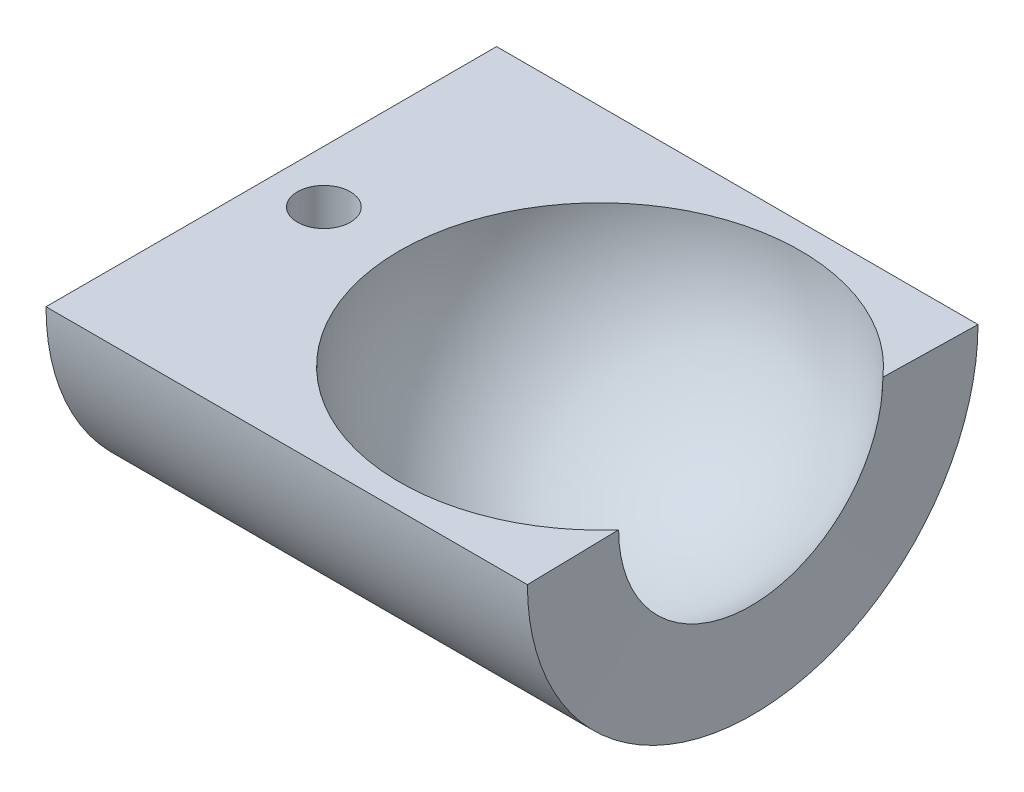
ISO-10303-21;
HEADER;
FILE_DESCRIPTION(('STEP AP214'),'2;1');
FILE_NAME('part.step','',(''),(''),'','','');
FILE_SCHEMA(('AUTOMOTIVE_DESIGN { 1 0 10303 214 1 1 1 1 }'));
ENDSEC;
DATA;
#1=APPLICATION_CONTEXT('core data for automotive mechanical design processes');
#2=APPLICATION_PROTOCOL_DEFINITION('international standard','automotive_design',2000,#1);
#3=PRODUCT_CONTEXT('',#1,'mechanical');
#4=PRODUCT('Part','Part','',(#3));
#5=PRODUCT_RELATED_PRODUCT_CATEGORY('part','',(#4));
#6=PRODUCT_DEFINITION_FORMATION('','',#4);
#7=PRODUCT_DEFINITION_CONTEXT('part definition',#1,'design');
#8=PRODUCT_DEFINITION('design','',#6,#7);
#9=PRODUCT_DEFINITION_SHAPE('','',#8);
#10=(LENGTH_UNIT() NAMED_UNIT(*) SI_UNIT(.MILLI.,.METRE.));
#11=(NAMED_UNIT(*) PLANE_ANGLE_UNIT() SI_UNIT($,.RADIAN.));
#12=(NAMED_UNIT(*) SI_UNIT($,.STERADIAN.) SOLID_ANGLE_UNIT());
#13=UNCERTAINTY_MEASURE_WITH_UNIT(LENGTH_MEASURE(1.E-05),#10,'distance_accuracy_value','');
#14=(GEOMETRIC_REPRESENTATION_CONTEXT(3) GLOBAL_UNCERTAINTY_ASSIGNED_CONTEXT((#13)) GLOBAL_UNIT_ASSIGNED_CONTEXT((#10,
#11,#12)) REPRESENTATION_CONTEXT('',''));
#15=CARTESIAN_POINT('',(0.,0.,0.));
#16=DIRECTION('',(0.,0.,1.));
#17=DIRECTION('',(1.,0.,0.));
#18=AXIS2_PLACEMENT_3D('',#15,#16,#17);
#19=CARTESIAN_POINT('',(0.,0.,0.));
#20=DIRECTION('',(1.,0.,0.));
#21=DIRECTION('',(0.,0.,1.));
#22=AXIS2_PLACEMENT_3D('',#19,#20,#21);
#23=SPHERICAL_SURFACE('',#22,12.5);
#24=CARTESIAN_POINT('',(0.,0.,0.));
#25=DIRECTION('',(0.,-1.,0.));
#26=DIRECTION('',(0.,0.,-1.));
#27=AXIS2_PLACEMENT_3D('',#24,#25,#26);
#28=CIRCLE('',#27,12.5);
#29=CARTESIAN_POINT('',(9.39995104684858,0.,8.23959466945135));
#30=VERTEX_POINT('',#29);
#31=CARTESIAN_POINT('',(9.39995104684858,0.,-8.2395946694513));
#32=VERTEX_POINT('',#31);
#33=EDGE_CURVE('E86',#30,#32,#28,.T.);
#34=ORIENTED_EDGE('',*,*,#33,.F.);
#35=CARTESIAN_POINT('',(9.39995104684858,0.,0.));
#36=DIRECTION('',(1.,0.,0.));
#37=DIRECTION('',(0.,0.,-1.));
#38=AXIS2_PLACEMENT_3D('',#35,#36,#37);
#39=CIRCLE('',#38,8.2395946694513);
#40=EDGE_CURVE('E40',#30,#32,#39,.T.);
#41=ORIENTED_EDGE('',*,*,#40,.T.);
#42=EDGE_LOOP('',(#34,#41));
#43=FACE_BOUND('',#42,.T.);
#44=ADVANCED_FACE('F33',(#43),#23,.F.);
#45=CARTESIAN_POINT('',(9.39995104684858,0.,0.));
#46=DIRECTION('',(1.,0.,0.));
#47=DIRECTION('',(0.,0.,-1.));
#48=AXIS2_PLACEMENT_3D('',#45,#46,#47);
#49=CONICAL_SURFACE('',#48,8.2395946694513,1.54995330868802);
#50=DIRECTION('',(0.0208415089960498,0.,-0.999782792161761));
#51=VECTOR('',#50,1.);
#52=CARTESIAN_POINT('',(9.22818815217436,0.,0.));
#53=LINE('',#52,#51);
#54=CARTESIAN_POINT('',(9.52106407032024,0.,-14.0494770919092));
#55=VERTEX_POINT('',#54);
#56=EDGE_CURVE('E51',#32,#55,#53,.T.);
#57=ORIENTED_EDGE('',*,*,#56,.F.);
#58=ORIENTED_EDGE('',*,*,#40,.F.);
#59=DIRECTION('',(-0.0208415089960498,0.,-0.999782792161761));
#60=VECTOR('',#59,1.);
#61=CARTESIAN_POINT('',(9.22818815217436,0.,0.));
#62=LINE('',#61,#60);
#63=CARTESIAN_POINT('',(9.52106407032024,0.,14.0494770919092));
#64=VERTEX_POINT('',#63);
#65=EDGE_CURVE('E74',#64,#30,#62,.T.);
#66=ORIENTED_EDGE('',*,*,#65,.F.);
#67=CARTESIAN_POINT('',(9.52106407032024,0.,0.));
#68=DIRECTION('',(1.,0.,0.));
#69=DIRECTION('',(0.,0.,-1.));
#70=AXIS2_PLACEMENT_3D('',#67,#68,#69);
#71=CIRCLE('',#70,14.0494770919092);
#72=EDGE_CURVE('E73',#64,#55,#71,.T.);
#73=ORIENTED_EDGE('',*,*,#72,.T.);
#74=EDGE_LOOP('',(#57,#58,#66,#73));
#75=FACE_BOUND('',#74,.T.);
#76=ADVANCED_FACE('F88',(#75),#49,.F.);
#77=CARTESIAN_POINT('',(-12.5,0.,0.));
#78=DIRECTION('',(1.,0.,0.));
#79=DIRECTION('',(0.,0.,-1.));
#80=AXIS2_PLACEMENT_3D('',#77,#78,#79);
#81=CYLINDRICAL_SURFACE('',#80,14.0494770919092);
#82=CARTESIAN_POINT('',(-17.2217247394002,-13.9522509494375,1.65));
#83=CARTESIAN_POINT('',(-17.3140624248878,-13.9522522044542,1.64999604842933));
#84=CARTESIAN_POINT('',(-17.4064589121021,-13.9531774941187,1.64222272634515));
#85=CARTESIAN_POINT('',(-17.5886836352696,-13.9567775667967,1.61133452476932));
#86=CARTESIAN_POINT('',(-17.6785090336758,-13.9594542104296,1.58820332885361));
#87=CARTESIAN_POINT('',(-17.852926694007,-13.966249725223,1.52728795341867));
#88=CARTESIAN_POINT('',(-17.9375223421071,-13.9703676514218,1.48951337293967));
#89=CARTESIAN_POINT('',(-18.0991568720913,-13.9795805993173,1.4004034095764));
#90=CARTESIAN_POINT('',(-18.1761971101884,-13.9846754451677,1.3490704665807));
#91=CARTESIAN_POINT('',(-18.3209324453093,-13.9952964615243,1.2340281192762));
#92=CARTESIAN_POINT('',(-18.3885847019256,-14.0008244400982,1.17026497843969));
#93=CARTESIAN_POINT('',(-18.5122539718135,-14.0116725547336,1.03228770983866));
#94=CARTESIAN_POINT('',(-18.5682704216953,-14.016992680721,0.958073076319042));
#95=CARTESIAN_POINT('',(-18.6672300917753,-14.0268439885374,0.801032119260877));
#96=CARTESIAN_POINT('',(-18.7101347787808,-14.0313728285242,0.71818135455179));
#97=CARTESIAN_POINT('',(-18.7814063138586,-14.0391114692741,0.546388735910669));
#98=CARTESIAN_POINT('',(-18.8097736409872,-14.0423213135018,0.457447082803947));
#99=CARTESIAN_POINT('',(-18.851037868176,-14.0470475773654,0.276434209554184));
#100=CARTESIAN_POINT('',(-18.8640057727092,-14.0485717670527,0.184379381911657));
#101=CARTESIAN_POINT('',(-18.8743229827714,-14.049781488474,-0.000611723869010534));
#102=CARTESIAN_POINT('',(-18.8716728346763,-14.0494670845288,-0.0935479710583573));
#103=CARTESIAN_POINT('',(-18.8508863082696,-14.0470413530556,-0.277181058113593));
#104=CARTESIAN_POINT('',(-18.8328262886412,-14.0449388858708,-0.367886674943284));
#105=CARTESIAN_POINT('',(-18.7818519088057,-14.0391832797136,-0.544970605274975));
#106=CARTESIAN_POINT('',(-18.7489372945614,-14.035530114222,-0.631348844743921));
#107=CARTESIAN_POINT('',(-18.6691060306813,-14.0270683898862,-0.797563853254607));
#108=CARTESIAN_POINT('',(-18.622156094399,-14.0222570897141,-0.877384489861531));
#109=CARTESIAN_POINT('',(-18.5156111204684,-14.0120179016479,-1.02804247992091));
#110=CARTESIAN_POINT('',(-18.4560155707628,-14.0065899887894,-1.09887946941392));
#111=CARTESIAN_POINT('',(-18.3254428129604,-13.99568691565,-1.23000753199177));
#112=CARTESIAN_POINT('',(-18.2543990959494,-13.9902116679069,-1.29023238996543));
#113=CARTESIAN_POINT('',(-18.1031758320774,-13.9798634565398,-1.39791265162449));
#114=CARTESIAN_POINT('',(-18.0229962622927,-13.974990494427,-1.44536802326769));
#115=CARTESIAN_POINT('',(-17.8557209415575,-13.9663985131409,-1.52616467184627));
#116=CARTESIAN_POINT('',(-17.7686227979468,-13.9626798953773,-1.55950104052845));
#117=CARTESIAN_POINT('',(-17.5900115820936,-13.9568256454114,-1.61105673321003));
#118=CARTESIAN_POINT('',(-17.4984986970804,-13.9546899461402,-1.62927669770157));
#119=CARTESIAN_POINT('',(-17.3142393758038,-13.9522554253381,-1.64999551396885));
#120=CARTESIAN_POINT('',(-17.2215035354407,-13.9519457371397,-1.65258737135033));
#121=CARTESIAN_POINT('',(-17.0369189413981,-13.9531695866319,-1.64222142561421));
#122=CARTESIAN_POINT('',(-16.9450701711107,-13.9547030897462,-1.62926391418676));
#123=CARTESIAN_POINT('',(-16.7651431963952,-13.9594306310537,-1.5882451962846));
#124=CARTESIAN_POINT('',(-16.6770546635392,-13.9626197549585,-1.56022867997235));
#125=CARTESIAN_POINT('',(-16.5068262334062,-13.9702952244536,-1.48993311698964));
#126=CARTESIAN_POINT('',(-16.4246865218702,-13.9747816105267,-1.44765362521707));
#127=CARTESIAN_POINT('',(-16.2682655685862,-13.984572228809,-1.34980219725816));
#128=CARTESIAN_POINT('',(-16.1940228479331,-13.9898801852748,-1.29416906157689));
#129=CARTESIAN_POINT('',(-16.0558956105992,-14.0007040273868,-1.17127646878048));
#130=CARTESIAN_POINT('',(-15.9920114489396,-14.0062199201517,-1.10401661334327));
#131=CARTESIAN_POINT('',(-15.8760899990147,-14.0168713355458,-0.959374461814386));
#132=CARTESIAN_POINT('',(-15.8241136822176,-14.0220048135432,-0.881943129073083));
#133=CARTESIAN_POINT('',(-15.7339044624672,-14.0312826981079,-0.719395690827859));
#134=CARTESIAN_POINT('',(-15.6956713106463,-14.0354271225849,-0.634279724515683));
#135=CARTESIAN_POINT('',(-15.6341352625574,-14.0422508154538,-0.458985068663327));
#136=CARTESIAN_POINT('',(-15.6107966144829,-14.0449335900119,-0.368819071661391));
#137=CARTESIAN_POINT('',(-15.5795956375379,-14.0485462148428,-0.185814752908457));
#138=CARTESIAN_POINT('',(-15.5717326966534,-14.0494761344353,-0.0929765369823853));
#139=CARTESIAN_POINT('',(-15.5717168416594,-14.0494780422557,0.0921404161207521));
#140=CARTESIAN_POINT('',(-15.5794697088063,-14.0485611731731,0.184419159390248));
#141=CARTESIAN_POINT('',(-15.6102664867702,-14.0449946066514,0.366352908323302));
#142=CARTESIAN_POINT('',(-15.6333103952221,-14.0423449094804,0.456007914392683));
#143=CARTESIAN_POINT('',(-15.6940066326422,-14.0356092124401,0.630140578480286));
#144=CARTESIAN_POINT('',(-15.7316550060915,-14.0315236015064,0.714619631202103));
#145=CARTESIAN_POINT('',(-15.820481695475,-14.0223694581733,0.876075318878423));
#146=CARTESIAN_POINT('',(-15.8716600952529,-14.0173009196829,0.953051907337099));
#147=CARTESIAN_POINT('',(-15.9864444610345,-14.0067108307481,1.09779960312614));
#148=CARTESIAN_POINT('',(-16.0501206066215,-14.0011868292922,1.16551488160426));
#149=CARTESIAN_POINT('',(-16.187948684426,-13.9903284566419,1.2893370950803));
#150=CARTESIAN_POINT('',(-16.2621031036992,-13.984994130845,1.34544126632607));
#151=CARTESIAN_POINT('',(-16.4190703443139,-13.9750996278775,1.44460950599934));
#152=CARTESIAN_POINT('',(-16.5019119114721,-13.970542160829,1.4876283187175));
#153=CARTESIAN_POINT('',(-16.673648283434,-13.9627492577276,1.55908413810042));
#154=CARTESIAN_POINT('',(-16.7625363020749,-13.959512367198,1.58753719626826));
#155=CARTESIAN_POINT('',(-16.9135366403943,-13.955523007828,1.62214903106224));
#156=CARTESIAN_POINT('',(-16.9746919963512,-13.9543019952605,1.63257837148499));
#157=CARTESIAN_POINT('',(-17.0977976545591,-13.9526655474577,1.64650515994458));
#158=CARTESIAN_POINT('',(-17.1597479517272,-13.952250107074,1.65000265228281));
#159=CARTESIAN_POINT('',(-17.2217247394002,-13.9522509494375,1.65));
#160=B_SPLINE_CURVE_WITH_KNOTS('',3,(#82,#83,#84,#85,#86,#87,#88,#89,#90,#91,#92,#93,#94,#95,
#96,#97,#98,#99,#100,#101,#102,#103,#104,#105,#106,#107,#108,#109,#110,#111,#112,#113,#114,#115,
#116,#117,#118,#119,#120,#121,#122,#123,#124,#125,#126,#127,#128,#129,#130,#131,#132,#133,#134,
#135,#136,#137,#138,#139,#140,#141,#142,#143,#144,#145,#146,#147,#148,#149,#150,#151,#152,#153,
#154,#155,#156,#157,#158,#159),.UNSPECIFIED.,.T.,.F.,(4,2,2,2,2,2,2,2,2,2,2,2,2,2,2,2,2,2,2,2,2,
2,2,2,2,2,2,2,2,2,2,2,2,2,2,2,2,2,4),(0.,0.27678667315965,0.553867879978001,0.830767760663942,
1.10761784587528,1.38569243116564,1.66378047730825,1.94267808636446,2.22156650419041,
2.49916395282933,2.77675169016594,3.05297186556869,3.32919676495166,3.60608203723761,
3.88297852354801,4.16154585029136,4.4401138760317,4.71877866231329,4.99743164077869,
5.27442465670411,5.55141247660703,5.82758279014972,6.10376172288718,6.38123139302388,
6.65871057093319,6.93758025581582,7.21644489054568,7.49463761369241,7.77281933499751,
8.04932766114503,8.32583594452375,8.60226938976562,8.87870454806921,9.15673885715189,
9.43483926986772,9.71389083449067,9.99263421790798,10.1784138204283,10.3641922356283),.UNSPECIFIED.);
#161=CARTESIAN_POINT('',(-17.2217247394002,-13.9522509494375,1.65));
#162=VERTEX_POINT('',#161);
#163=EDGE_CURVE('E75',#162,#162,#160,.T.);
#164=ORIENTED_EDGE('',*,*,#163,.F.);
#165=EDGE_LOOP('',(#164));
#166=FACE_BOUND('',#165,.T.);
#167=DIRECTION('',(1.,0.,0.));
#168=VECTOR('',#167,1.);
#169=CARTESIAN_POINT('',(-12.5,0.,-14.0494770919092));
#170=LINE('',#169,#168);
#171=CARTESIAN_POINT('',(-20.5,0.,-14.0494770919092));
#172=VERTEX_POINT('',#171);
#173=EDGE_CURVE('E46',#55,#172,#170,.F.);
#174=ORIENTED_EDGE('',*,*,#173,.F.);
#175=ORIENTED_EDGE('',*,*,#72,.F.);
#176=DIRECTION('',(1.,0.,0.));
#177=VECTOR('',#176,1.);
#178=CARTESIAN_POINT('',(-12.5,0.,14.0494770919092));
#179=LINE('',#178,#177);
#180=CARTESIAN_POINT('',(-20.5,0.,14.0494770919092));
#181=VERTEX_POINT('',#180);
#182=EDGE_CURVE('E63',#181,#64,#179,.T.);
#183=ORIENTED_EDGE('',*,*,#182,.F.);
#184=CARTESIAN_POINT('',(-20.5,0.,0.));
#185=DIRECTION('',(1.,0.,0.));
#186=DIRECTION('',(0.,0.,-1.));
#187=AXIS2_PLACEMENT_3D('',#184,#185,#186);
#188=CIRCLE('',#187,14.0494770919092);
#189=EDGE_CURVE('E71',#181,#172,#188,.T.);
#190=ORIENTED_EDGE('',*,*,#189,.T.);
#191=EDGE_LOOP('',(#174,#175,#183,#190));
#192=FACE_BOUND('',#191,.T.);
#193=ADVANCED_FACE('F70',(#166,#192),#81,.T.);
#194=CARTESIAN_POINT('',(-20.5,0.,-14.0494770919092));
#195=DIRECTION('',(-1.,0.,0.));
#196=DIRECTION('',(0.,0.,1.));
#197=AXIS2_PLACEMENT_3D('',#194,#195,#196);
#198=PLANE('',#197);
#199=DIRECTION('',(0.,0.,1.));
#200=VECTOR('',#199,1.);
#201=CARTESIAN_POINT('',(-20.5,0.,-14.0494770919092));
#202=LINE('',#201,#200);
#203=EDGE_CURVE('E11',#172,#181,#202,.T.);
#204=ORIENTED_EDGE('',*,*,#203,.F.);
#205=ORIENTED_EDGE('',*,*,#189,.F.);
#206=EDGE_LOOP('',(#204,#205));
#207=FACE_BOUND('',#206,.T.);
#208=ADVANCED_FACE('F77',(#207),#198,.T.);
#209=CARTESIAN_POINT('',(24.5,0.,0.));
#210=DIRECTION('',(0.,-1.,0.));
#211=DIRECTION('',(0.,0.,-1.));
#212=AXIS2_PLACEMENT_3D('',#209,#210,#211);
#213=PLANE('',#212);
#214=CARTESIAN_POINT('',(-17.2217247394002,0.,0.));
#215=DIRECTION('',(0.,1.,0.));
#216=DIRECTION('',(0.,0.,1.));
#217=AXIS2_PLACEMENT_3D('',#214,#215,#216);
#218=CIRCLE('',#217,1.65);
#219=CARTESIAN_POINT('',(-17.2217247394002,0.,1.65));
#220=VERTEX_POINT('',#219);
#221=EDGE_CURVE('E98',#220,#220,#218,.T.);
#222=ORIENTED_EDGE('',*,*,#221,.F.);
#223=EDGE_LOOP('',(#222));
#224=FACE_BOUND('',#223,.T.);
#225=ORIENTED_EDGE('',*,*,#173,.T.);
#226=ORIENTED_EDGE('',*,*,#203,.T.);
#227=ORIENTED_EDGE('',*,*,#182,.T.);
#228=ORIENTED_EDGE('',*,*,#65,.T.);
#229=ORIENTED_EDGE('',*,*,#33,.T.);
#230=ORIENTED_EDGE('',*,*,#56,.T.);
#231=EDGE_LOOP('',(#225,#226,#227,#228,#229,#230));
#232=FACE_BOUND('',#231,.T.);
#233=ADVANCED_FACE('F62',(#224,#232),#213,.F.);
#234=CARTESIAN_POINT('',(-17.2217247394002,-20.,0.));
#235=DIRECTION('',(0.,1.,0.));
#236=DIRECTION('',(0.,0.,1.));
#237=AXIS2_PLACEMENT_3D('',#234,#235,#236);
#238=CYLINDRICAL_SURFACE('',#237,1.65);
#239=ORIENTED_EDGE('',*,*,#163,.T.);
#240=EDGE_LOOP('',(#239));
#241=FACE_BOUND('',#240,.T.);
#242=ORIENTED_EDGE('',*,*,#221,.T.);
#243=EDGE_LOOP('',(#242));
#244=FACE_BOUND('',#243,.T.);
#245=ADVANCED_FACE('F101',(#241,#244),#238,.F.);
#246=CLOSED_SHELL('',(#44,#76,#193,#208,#233,#245));
#247=MANIFOLD_SOLID_BREP('B2',#246);
#248=ADVANCED_BREP_SHAPE_REPRESENTATION('',(#18,#247),#14);
#249=SHAPE_DEFINITION_REPRESENTATION(#9,#248);
ENDSEC;
END-ISO-10303-21;
